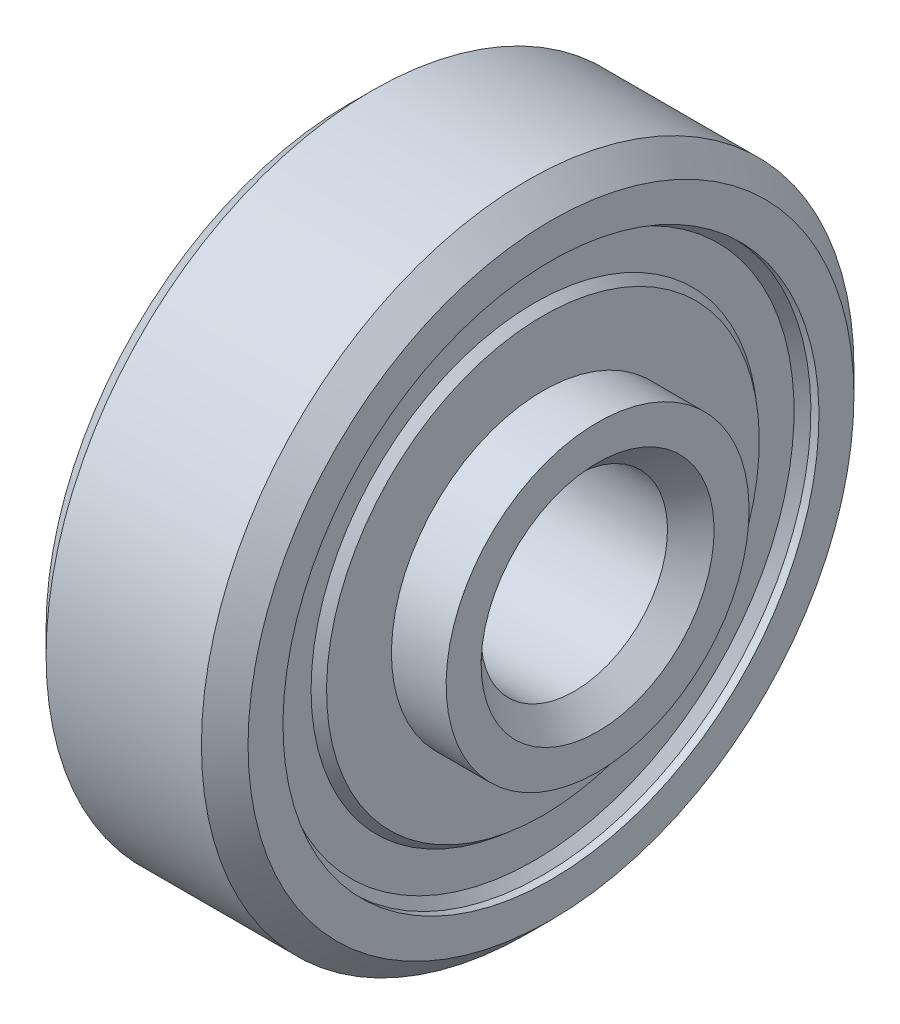
ISO-10303-21;
HEADER;
FILE_DESCRIPTION(('STEP AP214'),'2;1');
FILE_NAME('part.step','',(''),(''),'','','');
FILE_SCHEMA(('AUTOMOTIVE_DESIGN { 1 0 10303 214 1 1 1 1 }'));
ENDSEC;
DATA;
#1=APPLICATION_CONTEXT('core data for automotive mechanical design processes');
#2=APPLICATION_PROTOCOL_DEFINITION('international standard','automotive_design',2000,#1);
#3=PRODUCT_CONTEXT('',#1,'mechanical');
#4=PRODUCT('Part','Part','',(#3));
#5=PRODUCT_RELATED_PRODUCT_CATEGORY('part','',(#4));
#6=PRODUCT_DEFINITION_FORMATION('','',#4);
#7=PRODUCT_DEFINITION_CONTEXT('part definition',#1,'design');
#8=PRODUCT_DEFINITION('design','',#6,#7);
#9=PRODUCT_DEFINITION_SHAPE('','',#8);
#10=(LENGTH_UNIT() NAMED_UNIT(*) SI_UNIT(.MILLI.,.METRE.));
#11=(NAMED_UNIT(*) PLANE_ANGLE_UNIT() SI_UNIT($,.RADIAN.));
#12=(NAMED_UNIT(*) SI_UNIT($,.STERADIAN.) SOLID_ANGLE_UNIT());
#13=UNCERTAINTY_MEASURE_WITH_UNIT(LENGTH_MEASURE(1.E-05),#10,'distance_accuracy_value','');
#14=(GEOMETRIC_REPRESENTATION_CONTEXT(3) GLOBAL_UNCERTAINTY_ASSIGNED_CONTEXT((#13)) GLOBAL_UNIT_ASSIGNED_CONTEXT((#10,
#11,#12)) REPRESENTATION_CONTEXT('',''));
#15=CARTESIAN_POINT('',(0.,0.,0.));
#16=DIRECTION('',(0.,0.,1.));
#17=DIRECTION('',(1.,0.,0.));
#18=AXIS2_PLACEMENT_3D('',#15,#16,#17);
#19=CARTESIAN_POINT('',(11.6666666666667,0.,0.));
#20=DIRECTION('',(-1.,0.,0.));
#21=DIRECTION('',(0.,-1.,0.));
#22=AXIS2_PLACEMENT_3D('',#19,#20,#21);
#23=TOROIDAL_SURFACE('',#22,13.3249973942044,1.875);
#24=CARTESIAN_POINT('',(12.0967939863605,0.,0.));
#25=DIRECTION('',(-1.,0.,0.));
#26=DIRECTION('',(0.,-1.,0.));
#27=AXIS2_PLACEMENT_3D('',#24,#25,#26);
#28=CIRCLE('',#27,11.4999999999999);
#29=CARTESIAN_POINT('',(12.0967939863606,-11.4999999999998,0.));
#30=VERTEX_POINT('',#29);
#31=EDGE_CURVE('E89',#30,#30,#28,.T.);
#32=ORIENTED_EDGE('',*,*,#31,.T.);
#33=EDGE_LOOP('',(#32));
#34=FACE_BOUND('',#33,.T.);
#35=CARTESIAN_POINT('',(11.236539346973,0.,0.));
#36=DIRECTION('',(-1.,0.,0.));
#37=DIRECTION('',(0.,-1.,0.));
#38=AXIS2_PLACEMENT_3D('',#35,#36,#37);
#39=CIRCLE('',#38,11.4999999999999);
#40=CARTESIAN_POINT('',(11.2365393469731,-11.4999999999999,0.));
#41=VERTEX_POINT('',#40);
#42=EDGE_CURVE('E11',#41,#41,#39,.T.);
#43=ORIENTED_EDGE('',*,*,#42,.F.);
#44=EDGE_LOOP('',(#43));
#45=FACE_BOUND('',#44,.T.);
#46=ADVANCED_FACE('F43',(#34,#45),#23,.F.);
#47=CARTESIAN_POINT('',(0.,0.,0.));
#48=DIRECTION('',(-1.,0.,0.));
#49=DIRECTION('',(0.,-1.,0.));
#50=AXIS2_PLACEMENT_3D('',#47,#48,#49);
#51=CYLINDRICAL_SURFACE('',#50,11.4999999999999);
#52=ORIENTED_EDGE('',*,*,#42,.T.);
#53=EDGE_LOOP('',(#52));
#54=FACE_BOUND('',#53,.T.);
#55=CARTESIAN_POINT('',(7.76346065302716,0.,0.));
#56=DIRECTION('',(-1.,0.,0.));
#57=DIRECTION('',(0.,-1.,0.));
#58=AXIS2_PLACEMENT_3D('',#55,#56,#57);
#59=CIRCLE('',#58,11.5);
#60=CARTESIAN_POINT('',(7.76346065302723,-11.4999999999999,0.));
#61=VERTEX_POINT('',#60);
#62=EDGE_CURVE('E49',#61,#61,#59,.T.);
#63=ORIENTED_EDGE('',*,*,#62,.F.);
#64=EDGE_LOOP('',(#63));
#65=FACE_BOUND('',#64,.T.);
#66=ADVANCED_FACE('F107',(#54,#65),#51,.T.);
#67=CARTESIAN_POINT('',(7.33333333333341,0.,0.));
#68=DIRECTION('',(-1.,0.,0.));
#69=DIRECTION('',(0.,-1.,0.));
#70=AXIS2_PLACEMENT_3D('',#67,#68,#69);
#71=TOROIDAL_SURFACE('',#70,13.3249973942044,1.875);
#72=ORIENTED_EDGE('',*,*,#62,.T.);
#73=EDGE_LOOP('',(#72));
#74=FACE_BOUND('',#73,.T.);
#75=CARTESIAN_POINT('',(6.90320601363964,0.,0.));
#76=DIRECTION('',(-1.,0.,0.));
#77=DIRECTION('',(0.,-1.,0.));
#78=AXIS2_PLACEMENT_3D('',#75,#76,#77);
#79=CIRCLE('',#78,11.5);
#80=CARTESIAN_POINT('',(6.90320601363971,-11.4999999999999,0.));
#81=VERTEX_POINT('',#80);
#82=EDGE_CURVE('E53',#81,#81,#79,.T.);
#83=ORIENTED_EDGE('',*,*,#82,.F.);
#84=EDGE_LOOP('',(#83));
#85=FACE_BOUND('',#84,.T.);
#86=ADVANCED_FACE('F111',(#74,#85),#71,.F.);
#87=CARTESIAN_POINT('',(0.,0.,0.));
#88=DIRECTION('',(-1.,0.,0.));
#89=DIRECTION('',(0.,-1.,0.));
#90=AXIS2_PLACEMENT_3D('',#87,#88,#89);
#91=CYLINDRICAL_SURFACE('',#90,11.5);
#92=ORIENTED_EDGE('',*,*,#82,.T.);
#93=EDGE_LOOP('',(#92));
#94=FACE_BOUND('',#93,.T.);
#95=CARTESIAN_POINT('',(5.16666666666674,0.,0.));
#96=DIRECTION('',(-1.,0.,0.));
#97=DIRECTION('',(0.,-1.,0.));
#98=AXIS2_PLACEMENT_3D('',#95,#96,#97);
#99=CIRCLE('',#98,11.5);
#100=CARTESIAN_POINT('',(5.16666666666681,-11.4999999999999,0.));
#101=VERTEX_POINT('',#100);
#102=EDGE_CURVE('E57',#101,#101,#99,.T.);
#103=ORIENTED_EDGE('',*,*,#102,.F.);
#104=EDGE_LOOP('',(#103));
#105=FACE_BOUND('',#104,.T.);
#106=ADVANCED_FACE('F115',(#94,#105),#91,.T.);
#107=CARTESIAN_POINT('',(4.62500000000006,0.,0.));
#108=DIRECTION('',(1.,0.,0.));
#109=DIRECTION('',(0.,1.,0.));
#110=AXIS2_PLACEMENT_3D('',#107,#108,#109);
#111=CONICAL_SURFACE('',#110,9.74999999999997,1.27062515596478);
#112=ORIENTED_EDGE('',*,*,#102,.T.);
#113=EDGE_LOOP('',(#112));
#114=FACE_BOUND('',#113,.T.);
#115=CARTESIAN_POINT('',(4.62500000000006,0.,0.));
#116=DIRECTION('',(-1.,0.,0.));
#117=DIRECTION('',(0.,-1.,0.));
#118=AXIS2_PLACEMENT_3D('',#115,#116,#117);
#119=CIRCLE('',#118,9.74999999999997);
#120=CARTESIAN_POINT('',(4.62500000000012,-9.74999999999995,0.));
#121=VERTEX_POINT('',#120);
#122=EDGE_CURVE('E62',#121,#121,#119,.T.);
#123=ORIENTED_EDGE('',*,*,#122,.F.);
#124=EDGE_LOOP('',(#123));
#125=FACE_BOUND('',#124,.T.);
#126=ADVANCED_FACE('F121',(#114,#125),#111,.T.);
#127=CARTESIAN_POINT('',(0.,0.,0.));
#128=DIRECTION('',(-1.,0.,0.));
#129=DIRECTION('',(0.,-1.,0.));
#130=AXIS2_PLACEMENT_3D('',#127,#128,#129);
#131=CYLINDRICAL_SURFACE('',#130,9.74999999999999);
#132=ORIENTED_EDGE('',*,*,#122,.T.);
#133=EDGE_LOOP('',(#132));
#134=FACE_BOUND('',#133,.T.);
#135=CARTESIAN_POINT('',(0.,0.,0.));
#136=DIRECTION('',(-1.,0.,0.));
#137=DIRECTION('',(0.,-1.,0.));
#138=AXIS2_PLACEMENT_3D('',#135,#136,#137);
#139=CIRCLE('',#138,9.75);
#140=CARTESIAN_POINT('',(1.15715623682421E-13,-9.75,0.));
#141=VERTEX_POINT('',#140);
#142=EDGE_CURVE('E65',#141,#141,#139,.T.);
#143=ORIENTED_EDGE('',*,*,#142,.F.);
#144=EDGE_LOOP('',(#143));
#145=FACE_BOUND('',#144,.T.);
#146=ADVANCED_FACE('F125',(#134,#145),#131,.T.);
#147=CARTESIAN_POINT('',(1.52655665885959E-13,-5.47038840179403,0.));
#148=DIRECTION('',(-1.,0.,0.));
#149=DIRECTION('',(0.,-1.,0.));
#150=AXIS2_PLACEMENT_3D('',#147,#148,#149);
#151=PLANE('',#150);
#152=ORIENTED_EDGE('',*,*,#142,.T.);
#153=EDGE_LOOP('',(#152));
#154=FACE_BOUND('',#153,.T.);
#155=CARTESIAN_POINT('',(0.,0.,0.));
#156=DIRECTION('',(-1.,0.,0.));
#157=DIRECTION('',(0.,-1.,0.));
#158=AXIS2_PLACEMENT_3D('',#155,#156,#157);
#159=CIRCLE('',#158,7.50000000010686);
#160=CARTESIAN_POINT('',(1.01822283886659E-13,-7.50000000010686,0.));
#161=VERTEX_POINT('',#160);
#162=EDGE_CURVE('E68',#161,#161,#159,.T.);
#163=ORIENTED_EDGE('',*,*,#162,.F.);
#164=EDGE_LOOP('',(#163));
#165=FACE_BOUND('',#164,.T.);
#166=ADVANCED_FACE('F129',(#154,#165),#151,.T.);
#167=CARTESIAN_POINT('',(0.,0.,0.));
#168=DIRECTION('',(-1.,0.,0.));
#169=DIRECTION('',(0.,-1.,0.));
#170=AXIS2_PLACEMENT_3D('',#167,#168,#169);
#171=CONICAL_SURFACE('',#170,7.50000000010686,0.785398163397455);
#172=CARTESIAN_POINT('',(1.5000000001103,0.,0.));
#173=DIRECTION('',(-1.,0.,0.));
#174=DIRECTION('',(0.,-1.,0.));
#175=AXIS2_PLACEMENT_3D('',#172,#173,#174);
#176=CIRCLE('',#175,5.99999999999658);
#177=CARTESIAN_POINT('',(1.50000000011034,-5.99999999999658,0.));
#178=VERTEX_POINT('',#177);
#179=EDGE_CURVE('E71',#178,#178,#176,.T.);
#180=ORIENTED_EDGE('',*,*,#179,.F.);
#181=EDGE_LOOP('',(#180));
#182=FACE_BOUND('',#181,.T.);
#183=ORIENTED_EDGE('',*,*,#162,.T.);
#184=EDGE_LOOP('',(#183));
#185=FACE_BOUND('',#184,.T.);
#186=ADVANCED_FACE('F133',(#182,#185),#171,.F.);
#187=CARTESIAN_POINT('',(0.,0.,0.));
#188=DIRECTION('',(-1.,0.,0.));
#189=DIRECTION('',(0.,-1.,0.));
#190=AXIS2_PLACEMENT_3D('',#187,#188,#189);
#191=CYLINDRICAL_SURFACE('',#190,5.99999999999653);
#192=CARTESIAN_POINT('',(17.5000000001104,1.06685493772574E-13,0.));
#193=DIRECTION('',(-1.,0.,0.));
#194=DIRECTION('',(0.,-1.,0.));
#195=AXIS2_PLACEMENT_3D('',#192,#193,#194);
#196=CIRCLE('',#195,5.99999999999648);
#197=CARTESIAN_POINT('',(17.5000000001104,-5.99999999999638,0.));
#198=VERTEX_POINT('',#197);
#199=EDGE_CURVE('E74',#198,#198,#196,.T.);
#200=ORIENTED_EDGE('',*,*,#199,.F.);
#201=EDGE_LOOP('',(#200));
#202=FACE_BOUND('',#201,.T.);
#203=ORIENTED_EDGE('',*,*,#179,.T.);
#204=EDGE_LOOP('',(#203));
#205=FACE_BOUND('',#204,.T.);
#206=ADVANCED_FACE('F137',(#202,#205),#191,.F.);
#207=CARTESIAN_POINT('',(17.5000000001104,1.06685493772574E-13,0.));
#208=DIRECTION('',(1.,0.,0.));
#209=DIRECTION('',(0.,1.,0.));
#210=AXIS2_PLACEMENT_3D('',#207,#208,#209);
#211=CONICAL_SURFACE('',#210,5.99999999999648,0.785398163397442);
#212=CARTESIAN_POINT('',(19.0000000001104,1.17961196366423E-13,0.));
#213=DIRECTION('',(-1.,0.,0.));
#214=DIRECTION('',(0.,-1.,0.));
#215=AXIS2_PLACEMENT_3D('',#212,#213,#214);
#216=CIRCLE('',#215,7.49999999999647);
#217=CARTESIAN_POINT('',(19.0000000001104,-7.49999999999636,0.));
#218=VERTEX_POINT('',#217);
#219=EDGE_CURVE('E77',#218,#218,#216,.T.);
#220=ORIENTED_EDGE('',*,*,#219,.F.);
#221=EDGE_LOOP('',(#220));
#222=FACE_BOUND('',#221,.T.);
#223=ORIENTED_EDGE('',*,*,#199,.T.);
#224=EDGE_LOOP('',(#223));
#225=FACE_BOUND('',#224,.T.);
#226=ADVANCED_FACE('F141',(#222,#225),#211,.F.);
#227=CARTESIAN_POINT('',(19.0000000001104,-5.47038840179402,0.));
#228=DIRECTION('',(-1.,0.,0.));
#229=DIRECTION('',(0.,-1.,0.));
#230=AXIS2_PLACEMENT_3D('',#227,#228,#229);
#231=PLANE('',#230);
#232=CARTESIAN_POINT('',(19.0000000001104,1.17961196366423E-13,0.));
#233=DIRECTION('',(-1.,0.,0.));
#234=DIRECTION('',(0.,-1.,0.));
#235=AXIS2_PLACEMENT_3D('',#232,#233,#234);
#236=CIRCLE('',#235,9.74999999999988);
#237=CARTESIAN_POINT('',(19.0000000001104,-9.74999999999976,0.));
#238=VERTEX_POINT('',#237);
#239=EDGE_CURVE('E80',#238,#238,#236,.T.);
#240=ORIENTED_EDGE('',*,*,#239,.F.);
#241=EDGE_LOOP('',(#240));
#242=FACE_BOUND('',#241,.T.);
#243=ORIENTED_EDGE('',*,*,#219,.T.);
#244=EDGE_LOOP('',(#243));
#245=FACE_BOUND('',#244,.T.);
#246=ADVANCED_FACE('F145',(#242,#245),#231,.F.);
#247=CARTESIAN_POINT('',(0.,0.,0.));
#248=DIRECTION('',(-1.,0.,0.));
#249=DIRECTION('',(0.,-1.,0.));
#250=AXIS2_PLACEMENT_3D('',#247,#248,#249);
#251=CYLINDRICAL_SURFACE('',#250,9.7499999999999);
#252=ORIENTED_EDGE('',*,*,#239,.T.);
#253=EDGE_LOOP('',(#252));
#254=FACE_BOUND('',#253,.T.);
#255=CARTESIAN_POINT('',(14.3750000000001,0.,0.));
#256=DIRECTION('',(-1.,0.,0.));
#257=DIRECTION('',(0.,-1.,0.));
#258=AXIS2_PLACEMENT_3D('',#255,#256,#257);
#259=CIRCLE('',#258,9.74999999999991);
#260=CARTESIAN_POINT('',(14.3750000000001,-9.74999999999982,0.));
#261=VERTEX_POINT('',#260);
#262=EDGE_CURVE('E83',#261,#261,#259,.T.);
#263=ORIENTED_EDGE('',*,*,#262,.F.);
#264=EDGE_LOOP('',(#263));
#265=FACE_BOUND('',#264,.T.);
#266=ADVANCED_FACE('F103',(#254,#265),#251,.T.);
#267=CARTESIAN_POINT('',(13.8333333333334,0.,0.));
#268=DIRECTION('',(-1.,0.,0.));
#269=DIRECTION('',(0.,-1.,0.));
#270=AXIS2_PLACEMENT_3D('',#267,#268,#269);
#271=CONICAL_SURFACE('',#270,11.4999999999999,1.27062515596479);
#272=ORIENTED_EDGE('',*,*,#262,.T.);
#273=EDGE_LOOP('',(#272));
#274=FACE_BOUND('',#273,.T.);
#275=CARTESIAN_POINT('',(13.8333333333334,0.,0.));
#276=DIRECTION('',(-1.,0.,0.));
#277=DIRECTION('',(0.,-1.,0.));
#278=AXIS2_PLACEMENT_3D('',#275,#276,#277);
#279=CIRCLE('',#278,11.4999999999999);
#280=CARTESIAN_POINT('',(13.8333333333335,-11.4999999999998,0.));
#281=VERTEX_POINT('',#280);
#282=EDGE_CURVE('E86',#281,#281,#279,.T.);
#283=ORIENTED_EDGE('',*,*,#282,.F.);
#284=EDGE_LOOP('',(#283));
#285=FACE_BOUND('',#284,.T.);
#286=ADVANCED_FACE('F97',(#274,#285),#271,.T.);
#287=CARTESIAN_POINT('',(0.,0.,0.));
#288=DIRECTION('',(-1.,0.,0.));
#289=DIRECTION('',(0.,-1.,0.));
#290=AXIS2_PLACEMENT_3D('',#287,#288,#289);
#291=CYLINDRICAL_SURFACE('',#290,11.4999999999999);
#292=ORIENTED_EDGE('',*,*,#282,.T.);
#293=EDGE_LOOP('',(#292));
#294=FACE_BOUND('',#293,.T.);
#295=ORIENTED_EDGE('',*,*,#31,.F.);
#296=EDGE_LOOP('',(#295));
#297=FACE_BOUND('',#296,.T.);
#298=ADVANCED_FACE('F95',(#294,#297),#291,.T.);
#299=CLOSED_SHELL('',(#46,#66,#86,#106,#126,#146,#166,#186,#206,#226,#246,#266,#286,#298));
#300=MANIFOLD_SOLID_BREP('B2',#299);
#301=CARTESIAN_POINT('',(9.50000000000001,0.,0.));
#302=DIRECTION('',(-1.,0.,0.));
#303=DIRECTION('',(0.,1.,0.));
#304=AXIS2_PLACEMENT_3D('',#301,#302,#303);
#305=SPHERICAL_SURFACE('',#304,15.375);
#306=CARTESIAN_POINT('',(5.16666666666676,0.,0.));
#307=DIRECTION('',(-1.,0.,0.));
#308=DIRECTION('',(0.,-1.,0.));
#309=AXIS2_PLACEMENT_3D('',#306,#307,#308);
#310=CIRCLE('',#309,14.7517065867723);
#311=CARTESIAN_POINT('',(5.16666666666667,14.7517065867723,0.));
#312=VERTEX_POINT('',#311);
#313=EDGE_CURVE('E314',#312,#312,#310,.T.);
#314=CARTESIAN_POINT('',(13.8333333333334,0.,0.));
#315=DIRECTION('',(-1.,0.,0.));
#316=DIRECTION('',(0.,-1.,0.));
#317=AXIS2_PLACEMENT_3D('',#314,#315,#316);
#318=CIRCLE('',#317,14.7517065867723);
#319=CARTESIAN_POINT('',(13.8333333333333,14.7517065867723,0.));
#320=VERTEX_POINT('',#319);
#321=EDGE_CURVE('E42',#320,#320,#318,.T.);
#322=CARTESIAN_POINT('',(5.16666666666667,14.7517065867723,0.));
#323=CARTESIAN_POINT('',(5.2544744083613,14.7775003246166,0.));
#324=CARTESIAN_POINT('',(5.34251249946757,14.8025098875159,0.));
#325=CARTESIAN_POINT('',(5.51902119911412,14.8509530849714,0.));
#326=CARTESIAN_POINT('',(5.60749180765442,14.8743867195275,0.));
#327=CARTESIAN_POINT('',(5.78483736077979,14.9196704818431,0.));
#328=CARTESIAN_POINT('',(5.87371230536488,14.9415206096025,0.));
#329=CARTESIAN_POINT('',(6.05183818330579,14.9836304194508,0.));
#330=CARTESIAN_POINT('',(6.14108911666162,15.0038901015398,0.));
#331=CARTESIAN_POINT('',(6.31993851488075,15.0428125522382,0.));
#332=CARTESIAN_POINT('',(6.40953697974405,15.0614753208477,0.));
#333=CARTESIAN_POINT('',(6.58905287024463,15.0971979956518,0.));
#334=CARTESIAN_POINT('',(6.6789702958819,15.1142579018465,0.));
#335=CARTESIAN_POINT('',(6.85909543620113,15.1467694113984,0.));
#336=CARTESIAN_POINT('',(6.94930315088309,15.1622210147556,0.));
#337=CARTESIAN_POINT('',(7.12998010480774,15.191510991742,0.));
#338=CARTESIAN_POINT('',(7.22044934405043,15.2053493653711,0.));
#339=CARTESIAN_POINT('',(7.40162049927156,15.2314084702337,0.));
#340=CARTESIAN_POINT('',(7.49232241525,15.2436292014671,0.));
#341=CARTESIAN_POINT('',(7.67393000191058,15.2664491247364,0.));
#342=CARTESIAN_POINT('',(7.76483567259271,15.2770483167723,0.));
#343=CARTESIAN_POINT('',(7.94682178166121,15.29662178189,0.));
#344=CARTESIAN_POINT('',(8.03790222004757,15.3055960549718,0.));
#345=CARTESIAN_POINT('',(8.22020882179611,15.3219168205645,0.));
#346=CARTESIAN_POINT('',(8.31143498515827,15.3292633130755,0.));
#347=CARTESIAN_POINT('',(8.49400394766305,15.3423261749576,0.));
#348=CARTESIAN_POINT('',(8.58534674680566,15.3480425443289,0.));
#349=CARTESIAN_POINT('',(8.76811985448437,15.3578433371586,0.));
#350=CARTESIAN_POINT('',(8.85955016302047,15.3619277606172,0.));
#351=CARTESIAN_POINT('',(9.04246913519519,15.3684633592256,0.));
#352=CARTESIAN_POINT('',(9.1339577988338,15.3709145343754,0.));
#353=CARTESIAN_POINT('',(9.31696430831495,15.3741828547626,0.));
#354=CARTESIAN_POINT('',(9.40848215415747,15.375,0.));
#355=CARTESIAN_POINT('',(9.59151784584252,15.375,0.));
#356=CARTESIAN_POINT('',(9.68303569168505,15.3741828547626,0.));
#357=CARTESIAN_POINT('',(9.8660422011662,15.3709145343754,0.));
#358=CARTESIAN_POINT('',(9.95753086480481,15.3684633592256,0.));
#359=CARTESIAN_POINT('',(10.1404498369795,15.3619277606172,0.));
#360=CARTESIAN_POINT('',(10.2318801455156,15.3578433371586,0.));
#361=CARTESIAN_POINT('',(10.4146532531943,15.3480425443289,0.));
#362=CARTESIAN_POINT('',(10.505996052337,15.3423261749576,0.));
#363=CARTESIAN_POINT('',(10.6885650148417,15.3292633130755,0.));
#364=CARTESIAN_POINT('',(10.7797911782039,15.3219168205645,0.));
#365=CARTESIAN_POINT('',(10.9620977799524,15.3055960549718,0.));
#366=CARTESIAN_POINT('',(11.0531782183388,15.29662178189,0.));
#367=CARTESIAN_POINT('',(11.2351643274073,15.2770483167723,0.));
#368=CARTESIAN_POINT('',(11.3260699980894,15.2664491247364,0.));
#369=CARTESIAN_POINT('',(11.50767758475,15.2436292014671,0.));
#370=CARTESIAN_POINT('',(11.5983795007284,15.2314084702337,0.));
#371=CARTESIAN_POINT('',(11.7795506559496,15.2053493653711,0.));
#372=CARTESIAN_POINT('',(11.8700198951923,15.191510991742,0.));
#373=CARTESIAN_POINT('',(12.0506968491169,15.1622210147556,0.));
#374=CARTESIAN_POINT('',(12.1409045637989,15.1467694113984,0.));
#375=CARTESIAN_POINT('',(12.3210297041181,15.1142579018465,0.));
#376=CARTESIAN_POINT('',(12.4109471297554,15.0971979956518,0.));
#377=CARTESIAN_POINT('',(12.5904630202559,15.0614753208477,0.));
#378=CARTESIAN_POINT('',(12.6800614851193,15.0428125522382,0.));
#379=CARTESIAN_POINT('',(12.8589108833384,15.0038901015398,0.));
#380=CARTESIAN_POINT('',(12.9481618166942,14.9836304194508,0.));
#381=CARTESIAN_POINT('',(13.1262876946351,14.9415206096025,0.));
#382=CARTESIAN_POINT('',(13.2151626392202,14.9196704818431,0.));
#383=CARTESIAN_POINT('',(13.3925081923456,14.8743867195275,0.));
#384=CARTESIAN_POINT('',(13.4809788008859,14.8509530849714,0.));
#385=CARTESIAN_POINT('',(13.6574875005324,14.8025098875159,0.));
#386=CARTESIAN_POINT('',(13.7455255916387,14.7775003246166,0.));
#387=CARTESIAN_POINT('',(13.8333333333333,14.7517065867723,0.));
#388=B_SPLINE_CURVE_WITH_KNOTS('',3,(#322,#323,#324,#325,#326,#327,#328,#329,#330,#331,#332,
#333,#334,#335,#336,#337,#338,#339,#340,#341,#342,#343,#344,#345,#346,#347,#348,#349,#350,#351,
#352,#353,#354,#355,#356,#357,#358,#359,#360,#361,#362,#363,#364,#365,#366,#367,#368,#369,#370,
#371,#372,#373,#374,#375,#376,#377,#378,#379,#380,#381,#382,#383,#384,#385,#386,#387),
.UNSPECIFIED.,.F.,.F.,(4,2,2,2,2,2,2,2,2,2,2,2,2,2,2,2,2,2,2,2,2,2,2,2,2,2,2,2,2,2,2,2,4),(0.,
0.274549889824796,0.54909977964959,0.823649669474385,1.09819955929918,1.37274944912398,
1.64729933894877,1.92184922877357,2.19639911859836,2.47094900842316,2.74549889824795,
3.02004878807275,3.29459867789754,3.56914856772234,3.84369845754713,4.11824834737193,
4.39279823719672,4.66734812702152,4.94189801684631,5.2164479066711,5.4909977964959,
5.76554768632069,6.04009757614549,6.31464746597029,6.58919735579508,6.86374724561987,
7.13829713544467,7.41284702526947,7.68739691509426,7.96194680491905,8.23649669474385,
8.51104658456864,8.78559647439344),.UNSPECIFIED.);
#389=EDGE_CURVE('BSEAM274',#312,#320,#388,.T.);
#390=ORIENTED_EDGE('',*,*,#313,.T.);
#391=ORIENTED_EDGE('',*,*,#321,.F.);
#392=ORIENTED_EDGE('',*,*,#389,.T.);
#393=ORIENTED_EDGE('',*,*,#389,.F.);
#394=EDGE_LOOP('',(#390,#392,#391,#393));
#395=FACE_BOUND('',#394,.T.);
#396=ADVANCED_FACE('F274',(#395),#305,.F.);
#397=CARTESIAN_POINT('',(13.8333333333335,-5.47038840179402,0.));
#398=DIRECTION('',(1.,0.,0.));
#399=DIRECTION('',(0.,1.,0.));
#400=AXIS2_PLACEMENT_3D('',#397,#398,#399);
#401=PLANE('',#400);
#402=ORIENTED_EDGE('',*,*,#321,.T.);
#403=EDGE_LOOP('',(#402));
#404=FACE_BOUND('',#403,.T.);
#405=CARTESIAN_POINT('',(13.8333333333334,0.,0.));
#406=DIRECTION('',(-1.,0.,0.));
#407=DIRECTION('',(0.,-1.,0.));
#408=AXIS2_PLACEMENT_3D('',#405,#406,#407);
#409=CIRCLE('',#408,18.8966666666666);
#410=CARTESIAN_POINT('',(13.8333333333336,-18.8966666666665,0.));
#411=VERTEX_POINT('',#410);
#412=EDGE_CURVE('E280',#411,#411,#409,.T.);
#413=ORIENTED_EDGE('',*,*,#412,.F.);
#414=EDGE_LOOP('',(#413));
#415=FACE_BOUND('',#414,.T.);
#416=ADVANCED_FACE('F350',(#404,#415),#401,.T.);
#417=CARTESIAN_POINT('',(13.8333333333334,0.,0.));
#418=DIRECTION('',(-1.,0.,0.));
#419=DIRECTION('',(0.,-1.,0.));
#420=AXIS2_PLACEMENT_3D('',#417,#418,#419);
#421=CONICAL_SURFACE('',#420,18.8966666666666,0.78539816339745);
#422=CARTESIAN_POINT('',(15.4800000000001,0.,0.));
#423=DIRECTION('',(-1.,0.,0.));
#424=DIRECTION('',(0.,-1.,0.));
#425=AXIS2_PLACEMENT_3D('',#422,#423,#424);
#426=CIRCLE('',#425,17.2499999999999);
#427=CARTESIAN_POINT('',(15.4800000000002,-17.2499999999998,0.));
#428=VERTEX_POINT('',#427);
#429=EDGE_CURVE('E284',#428,#428,#426,.T.);
#430=ORIENTED_EDGE('',*,*,#429,.F.);
#431=EDGE_LOOP('',(#430));
#432=FACE_BOUND('',#431,.T.);
#433=ORIENTED_EDGE('',*,*,#412,.T.);
#434=EDGE_LOOP('',(#433));
#435=FACE_BOUND('',#434,.T.);
#436=ADVANCED_FACE('F354',(#432,#435),#421,.F.);
#437=CARTESIAN_POINT('',(0.,0.,0.));
#438=DIRECTION('',(-1.,0.,0.));
#439=DIRECTION('',(0.,-1.,0.));
#440=AXIS2_PLACEMENT_3D('',#437,#438,#439);
#441=CYLINDRICAL_SURFACE('',#440,17.2499999999999);
#442=CARTESIAN_POINT('',(16.0000000000001,0.,0.));
#443=DIRECTION('',(-1.,0.,0.));
#444=DIRECTION('',(0.,-1.,0.));
#445=AXIS2_PLACEMENT_3D('',#442,#443,#444);
#446=CIRCLE('',#445,17.2499999999999);
#447=CARTESIAN_POINT('',(16.0000000000002,-17.2499999999998,0.));
#448=VERTEX_POINT('',#447);
#449=EDGE_CURVE('E288',#448,#448,#446,.T.);
#450=ORIENTED_EDGE('',*,*,#449,.F.);
#451=EDGE_LOOP('',(#450));
#452=FACE_BOUND('',#451,.T.);
#453=ORIENTED_EDGE('',*,*,#429,.T.);
#454=EDGE_LOOP('',(#453));
#455=FACE_BOUND('',#454,.T.);
#456=ADVANCED_FACE('F358',(#452,#455),#441,.F.);
#457=CARTESIAN_POINT('',(16.0000000000002,-5.47038840179403,0.));
#458=DIRECTION('',(-1.,0.,0.));
#459=DIRECTION('',(0.,-1.,0.));
#460=AXIS2_PLACEMENT_3D('',#457,#458,#459);
#461=PLANE('',#460);
#462=CARTESIAN_POINT('',(16.0000000000001,0.,0.));
#463=DIRECTION('',(-1.,0.,0.));
#464=DIRECTION('',(0.,-1.,0.));
#465=AXIS2_PLACEMENT_3D('',#462,#463,#464);
#466=CIRCLE('',#465,19.4999999999999);
#467=CARTESIAN_POINT('',(16.0000000000002,-19.4999999999998,0.));
#468=VERTEX_POINT('',#467);
#469=EDGE_CURVE('E293',#468,#468,#466,.T.);
#470=ORIENTED_EDGE('',*,*,#469,.F.);
#471=EDGE_LOOP('',(#470));
#472=FACE_BOUND('',#471,.T.);
#473=ORIENTED_EDGE('',*,*,#449,.T.);
#474=EDGE_LOOP('',(#473));
#475=FACE_BOUND('',#474,.T.);
#476=ADVANCED_FACE('F365',(#472,#475),#461,.F.);
#477=CARTESIAN_POINT('',(14.5000000000001,0.,0.));
#478=DIRECTION('',(-1.,0.,0.));
#479=DIRECTION('',(0.,-1.,0.));
#480=AXIS2_PLACEMENT_3D('',#477,#478,#479);
#481=CONICAL_SURFACE('',#480,20.9999999999999,0.785398163397459);
#482=ORIENTED_EDGE('',*,*,#469,.T.);
#483=EDGE_LOOP('',(#482));
#484=FACE_BOUND('',#483,.T.);
#485=CARTESIAN_POINT('',(14.5000000000001,0.,0.));
#486=DIRECTION('',(-1.,0.,0.));
#487=DIRECTION('',(0.,-1.,0.));
#488=AXIS2_PLACEMENT_3D('',#485,#486,#487);
#489=CIRCLE('',#488,20.9999999999999);
#490=CARTESIAN_POINT('',(14.5000000000003,-20.9999999999998,0.));
#491=VERTEX_POINT('',#490);
#492=EDGE_CURVE('E296',#491,#491,#489,.T.);
#493=ORIENTED_EDGE('',*,*,#492,.F.);
#494=EDGE_LOOP('',(#493));
#495=FACE_BOUND('',#494,.T.);
#496=ADVANCED_FACE('F369',(#484,#495),#481,.T.);
#497=CARTESIAN_POINT('',(0.,0.,0.));
#498=DIRECTION('',(-1.,0.,0.));
#499=DIRECTION('',(0.,-1.,0.));
#500=AXIS2_PLACEMENT_3D('',#497,#498,#499);
#501=CYLINDRICAL_SURFACE('',#500,20.9999999999999);
#502=ORIENTED_EDGE('',*,*,#492,.T.);
#503=EDGE_LOOP('',(#502));
#504=FACE_BOUND('',#503,.T.);
#505=CARTESIAN_POINT('',(4.50000000000012,0.,0.));
#506=DIRECTION('',(-1.,0.,0.));
#507=DIRECTION('',(0.,-1.,0.));
#508=AXIS2_PLACEMENT_3D('',#505,#506,#507);
#509=CIRCLE('',#508,21.);
#510=CARTESIAN_POINT('',(4.50000000000025,-21.,0.));
#511=VERTEX_POINT('',#510);
#512=EDGE_CURVE('E299',#511,#511,#509,.T.);
#513=ORIENTED_EDGE('',*,*,#512,.F.);
#514=EDGE_LOOP('',(#513));
#515=FACE_BOUND('',#514,.T.);
#516=ADVANCED_FACE('F346',(#504,#515),#501,.T.);
#517=CARTESIAN_POINT('',(3.00000000000011,0.,0.));
#518=DIRECTION('',(1.,0.,0.));
#519=DIRECTION('',(0.,1.,0.));
#520=AXIS2_PLACEMENT_3D('',#517,#518,#519);
#521=CONICAL_SURFACE('',#520,19.5,0.785398163397442);
#522=ORIENTED_EDGE('',*,*,#512,.T.);
#523=EDGE_LOOP('',(#522));
#524=FACE_BOUND('',#523,.T.);
#525=CARTESIAN_POINT('',(3.00000000000011,0.,0.));
#526=DIRECTION('',(-1.,0.,0.));
#527=DIRECTION('',(0.,-1.,0.));
#528=AXIS2_PLACEMENT_3D('',#525,#526,#527);
#529=CIRCLE('',#528,19.5);
#530=CARTESIAN_POINT('',(3.00000000000023,-19.5,0.));
#531=VERTEX_POINT('',#530);
#532=EDGE_CURVE('E302',#531,#531,#529,.T.);
#533=ORIENTED_EDGE('',*,*,#532,.F.);
#534=EDGE_LOOP('',(#533));
#535=FACE_BOUND('',#534,.T.);
#536=ADVANCED_FACE('F340',(#524,#535),#521,.T.);
#537=CARTESIAN_POINT('',(3.00000000000021,-5.47038840179402,0.));
#538=DIRECTION('',(-1.,0.,0.));
#539=DIRECTION('',(0.,-1.,0.));
#540=AXIS2_PLACEMENT_3D('',#537,#538,#539);
#541=PLANE('',#540);
#542=ORIENTED_EDGE('',*,*,#532,.T.);
#543=EDGE_LOOP('',(#542));
#544=FACE_BOUND('',#543,.T.);
#545=CARTESIAN_POINT('',(3.00000000000011,0.,0.));
#546=DIRECTION('',(-1.,0.,0.));
#547=DIRECTION('',(0.,-1.,0.));
#548=AXIS2_PLACEMENT_3D('',#545,#546,#547);
#549=CIRCLE('',#548,17.25);
#550=CARTESIAN_POINT('',(3.00000000000022,-17.25,0.));
#551=VERTEX_POINT('',#550);
#552=EDGE_CURVE('E305',#551,#551,#549,.T.);
#553=ORIENTED_EDGE('',*,*,#552,.F.);
#554=EDGE_LOOP('',(#553));
#555=FACE_BOUND('',#554,.T.);
#556=ADVANCED_FACE('F335',(#544,#555),#541,.T.);
#557=CARTESIAN_POINT('',(0.,0.,0.));
#558=DIRECTION('',(-1.,0.,0.));
#559=DIRECTION('',(0.,-1.,0.));
#560=AXIS2_PLACEMENT_3D('',#557,#558,#559);
#561=CYLINDRICAL_SURFACE('',#560,17.25);
#562=CARTESIAN_POINT('',(3.52000000000011,0.,0.));
#563=DIRECTION('',(-1.,0.,0.));
#564=DIRECTION('',(0.,-1.,0.));
#565=AXIS2_PLACEMENT_3D('',#562,#563,#564);
#566=CIRCLE('',#565,17.25);
#567=CARTESIAN_POINT('',(3.52000000000021,-17.25,0.));
#568=VERTEX_POINT('',#567);
#569=EDGE_CURVE('E308',#568,#568,#566,.T.);
#570=ORIENTED_EDGE('',*,*,#569,.F.);
#571=EDGE_LOOP('',(#570));
#572=FACE_BOUND('',#571,.T.);
#573=ORIENTED_EDGE('',*,*,#552,.T.);
#574=EDGE_LOOP('',(#573));
#575=FACE_BOUND('',#574,.T.);
#576=ADVANCED_FACE('F329',(#572,#575),#561,.F.);
#577=CARTESIAN_POINT('',(3.52000000000011,0.,0.));
#578=DIRECTION('',(1.,0.,0.));
#579=DIRECTION('',(0.,1.,0.));
#580=AXIS2_PLACEMENT_3D('',#577,#578,#579);
#581=CONICAL_SURFACE('',#580,17.25,0.785398163397437);
#582=CARTESIAN_POINT('',(5.16666666666679,0.,0.));
#583=DIRECTION('',(-1.,0.,0.));
#584=DIRECTION('',(0.,-1.,0.));
#585=AXIS2_PLACEMENT_3D('',#582,#583,#584);
#586=CIRCLE('',#585,18.8966666666666);
#587=CARTESIAN_POINT('',(5.16666666666691,-18.8966666666666,0.));
#588=VERTEX_POINT('',#587);
#589=EDGE_CURVE('E311',#588,#588,#586,.T.);
#590=ORIENTED_EDGE('',*,*,#589,.F.);
#591=EDGE_LOOP('',(#590));
#592=FACE_BOUND('',#591,.T.);
#593=ORIENTED_EDGE('',*,*,#569,.T.);
#594=EDGE_LOOP('',(#593));
#595=FACE_BOUND('',#594,.T.);
#596=ADVANCED_FACE('F323',(#592,#595),#581,.F.);
#597=CARTESIAN_POINT('',(5.16666666666687,-5.47038840179405,0.));
#598=DIRECTION('',(1.,0.,0.));
#599=DIRECTION('',(0.,1.,0.));
#600=AXIS2_PLACEMENT_3D('',#597,#598,#599);
#601=PLANE('',#600);
#602=ORIENTED_EDGE('',*,*,#313,.F.);
#603=EDGE_LOOP('',(#602));
#604=FACE_BOUND('',#603,.T.);
#605=ORIENTED_EDGE('',*,*,#589,.T.);
#606=EDGE_LOOP('',(#605));
#607=FACE_BOUND('',#606,.T.);
#608=ADVANCED_FACE('F320',(#604,#607),#601,.F.);
#609=CLOSED_SHELL('',(#396,#416,#436,#456,#476,#496,#516,#536,#556,#576,#596,#608));
#610=MANIFOLD_SOLID_BREP('B6',#609);
#611=CARTESIAN_POINT('',(13.8333333333335,-5.47038840179402,0.));
#612=DIRECTION('',(-1.,0.,0.));
#613=DIRECTION('',(0.,-1.,0.));
#614=AXIS2_PLACEMENT_3D('',#611,#612,#613);
#615=PLANE('',#614);
#616=CARTESIAN_POINT('',(13.8333333333334,0.,0.));
#617=DIRECTION('',(-1.,0.,0.));
#618=DIRECTION('',(0.,-1.,0.));
#619=AXIS2_PLACEMENT_3D('',#616,#617,#618);
#620=CIRCLE('',#619,17.1660393197555);
#621=CARTESIAN_POINT('',(13.8333333333336,-17.1660393197554,0.));
#622=VERTEX_POINT('',#621);
#623=EDGE_CURVE('E512',#622,#622,#620,.T.);
#624=ORIENTED_EDGE('',*,*,#623,.T.);
#625=EDGE_LOOP('',(#624));
#626=FACE_BOUND('',#625,.T.);
#627=CARTESIAN_POINT('',(13.8333333333334,0.,0.));
#628=DIRECTION('',(-1.,0.,0.));
#629=DIRECTION('',(0.,-1.,0.));
#630=AXIS2_PLACEMENT_3D('',#627,#628,#629);
#631=CIRCLE('',#630,13.8657993844721);
#632=CARTESIAN_POINT('',(13.8333333333335,-13.865799384472,0.));
#633=VERTEX_POINT('',#632);
#634=EDGE_CURVE('E273',#633,#633,#631,.T.);
#635=ORIENTED_EDGE('',*,*,#634,.F.);
#636=EDGE_LOOP('',(#635));
#637=FACE_BOUND('',#636,.T.);
#638=ADVANCED_FACE('F478',(#626,#637),#615,.T.);
#639=CARTESIAN_POINT('',(13.8333333333334,0.,0.));
#640=DIRECTION('',(-1.,0.,0.));
#641=DIRECTION('',(0.,-1.,0.));
#642=AXIS2_PLACEMENT_3D('',#639,#640,#641);
#643=CONICAL_SURFACE('',#642,13.8657993844721,0.698131700797729);
#644=CARTESIAN_POINT('',(14.3750000000001,0.,0.));
#645=DIRECTION('',(-1.,0.,0.));
#646=DIRECTION('',(0.,-1.,0.));
#647=AXIS2_PLACEMENT_3D('',#644,#645,#646);
#648=CIRCLE('',#647,13.411287084251);
#649=CARTESIAN_POINT('',(14.3750000000002,-13.4112870842509,0.));
#650=VERTEX_POINT('',#649);
#651=EDGE_CURVE('E484',#650,#650,#648,.T.);
#652=ORIENTED_EDGE('',*,*,#651,.F.);
#653=EDGE_LOOP('',(#652));
#654=FACE_BOUND('',#653,.T.);
#655=ORIENTED_EDGE('',*,*,#634,.T.);
#656=EDGE_LOOP('',(#655));
#657=FACE_BOUND('',#656,.T.);
#658=ADVANCED_FACE('F530',(#654,#657),#643,.F.);
#659=CARTESIAN_POINT('',(14.3750000000002,-5.47038840179403,0.));
#660=DIRECTION('',(-1.,0.,0.));
#661=DIRECTION('',(0.,-1.,0.));
#662=AXIS2_PLACEMENT_3D('',#659,#660,#661);
#663=PLANE('',#662);
#664=ORIENTED_EDGE('',*,*,#651,.T.);
#665=EDGE_LOOP('',(#664));
#666=FACE_BOUND('',#665,.T.);
#667=CARTESIAN_POINT('',(14.3750000000001,0.,0.));
#668=DIRECTION('',(-1.,0.,0.));
#669=DIRECTION('',(0.,-1.,0.));
#670=AXIS2_PLACEMENT_3D('',#667,#668,#669);
#671=CIRCLE('',#670,9.74999999999991);
#672=CARTESIAN_POINT('',(14.3750000000001,-9.74999999999982,0.));
#673=VERTEX_POINT('',#672);
#674=EDGE_CURVE('E488',#673,#673,#671,.T.);
#675=ORIENTED_EDGE('',*,*,#674,.F.);
#676=EDGE_LOOP('',(#675));
#677=FACE_BOUND('',#676,.T.);
#678=ADVANCED_FACE('F534',(#666,#677),#663,.T.);
#679=CARTESIAN_POINT('',(0.,0.,0.));
#680=DIRECTION('',(-1.,0.,0.));
#681=DIRECTION('',(0.,-1.,0.));
#682=AXIS2_PLACEMENT_3D('',#679,#680,#681);
#683=CYLINDRICAL_SURFACE('',#682,9.74999999999991);
#684=CARTESIAN_POINT('',(15.4800000000001,0.,0.));
#685=DIRECTION('',(-1.,0.,0.));
#686=DIRECTION('',(0.,-1.,0.));
#687=AXIS2_PLACEMENT_3D('',#684,#685,#686);
#688=CIRCLE('',#687,9.7499999999999);
#689=CARTESIAN_POINT('',(15.4800000000001,-9.74999999999981,0.));
#690=VERTEX_POINT('',#689);
#691=EDGE_CURVE('E492',#690,#690,#688,.T.);
#692=ORIENTED_EDGE('',*,*,#691,.F.);
#693=EDGE_LOOP('',(#692));
#694=FACE_BOUND('',#693,.T.);
#695=ORIENTED_EDGE('',*,*,#674,.T.);
#696=EDGE_LOOP('',(#695));
#697=FACE_BOUND('',#696,.T.);
#698=ADVANCED_FACE('F539',(#694,#697),#683,.F.);
#699=CARTESIAN_POINT('',(15.4800000000002,-5.47038840179402,0.));
#700=DIRECTION('',(-1.,0.,0.));
#701=DIRECTION('',(0.,-1.,0.));
#702=AXIS2_PLACEMENT_3D('',#699,#700,#701);
#703=PLANE('',#702);
#704=CARTESIAN_POINT('',(15.4800000000001,0.,0.));
#705=DIRECTION('',(-1.,0.,0.));
#706=DIRECTION('',(0.,-1.,0.));
#707=AXIS2_PLACEMENT_3D('',#704,#705,#706);
#708=CIRCLE('',#707,13.9265570465123);
#709=CARTESIAN_POINT('',(15.4800000000002,-13.9265570465122,0.));
#710=VERTEX_POINT('',#709);
#711=EDGE_CURVE('E497',#710,#710,#708,.T.);
#712=ORIENTED_EDGE('',*,*,#711,.F.);
#713=EDGE_LOOP('',(#712));
#714=FACE_BOUND('',#713,.T.);
#715=ORIENTED_EDGE('',*,*,#691,.T.);
#716=EDGE_LOOP('',(#715));
#717=FACE_BOUND('',#716,.T.);
#718=ADVANCED_FACE('F544',(#714,#717),#703,.F.);
#719=CARTESIAN_POINT('',(14.9383333333334,0.,0.));
#720=DIRECTION('',(-1.,0.,0.));
#721=DIRECTION('',(0.,-1.,0.));
#722=AXIS2_PLACEMENT_3D('',#719,#720,#721);
#723=CONICAL_SURFACE('',#722,14.3810693467333,0.698131700797738);
#724=ORIENTED_EDGE('',*,*,#711,.T.);
#725=EDGE_LOOP('',(#724));
#726=FACE_BOUND('',#725,.T.);
#727=CARTESIAN_POINT('',(14.9383333333334,0.,0.));
#728=DIRECTION('',(-1.,0.,0.));
#729=DIRECTION('',(0.,-1.,0.));
#730=AXIS2_PLACEMENT_3D('',#727,#728,#729);
#731=CIRCLE('',#730,14.3810693467333);
#732=CARTESIAN_POINT('',(14.9383333333335,-14.3810693467332,0.));
#733=VERTEX_POINT('',#732);
#734=EDGE_CURVE('E500',#733,#733,#731,.T.);
#735=ORIENTED_EDGE('',*,*,#734,.F.);
#736=EDGE_LOOP('',(#735));
#737=FACE_BOUND('',#736,.T.);
#738=ADVANCED_FACE('F548',(#726,#737),#723,.T.);
#739=CARTESIAN_POINT('',(14.9383333333335,-5.47038840179403,0.));
#740=DIRECTION('',(-1.,0.,0.));
#741=DIRECTION('',(0.,-1.,0.));
#742=AXIS2_PLACEMENT_3D('',#739,#740,#741);
#743=PLANE('',#742);
#744=CARTESIAN_POINT('',(14.9383333333334,0.,0.));
#745=DIRECTION('',(-1.,0.,0.));
#746=DIRECTION('',(0.,-1.,0.));
#747=AXIS2_PLACEMENT_3D('',#744,#745,#746);
#748=CIRCLE('',#747,16.7083333333332);
#749=CARTESIAN_POINT('',(14.9383333333335,-16.7083333333331,0.));
#750=VERTEX_POINT('',#749);
#751=EDGE_CURVE('E503',#750,#750,#748,.T.);
#752=ORIENTED_EDGE('',*,*,#751,.F.);
#753=EDGE_LOOP('',(#752));
#754=FACE_BOUND('',#753,.T.);
#755=ORIENTED_EDGE('',*,*,#734,.T.);
#756=EDGE_LOOP('',(#755));
#757=FACE_BOUND('',#756,.T.);
#758=ADVANCED_FACE('F552',(#754,#757),#743,.F.);
#759=CARTESIAN_POINT('',(14.9383333333334,0.,0.));
#760=DIRECTION('',(1.,0.,0.));
#761=DIRECTION('',(0.,1.,0.));
#762=AXIS2_PLACEMENT_3D('',#759,#760,#761);
#763=CONICAL_SURFACE('',#762,16.7083333333332,0.785398163397447);
#764=CARTESIAN_POINT('',(15.4800000000001,0.,0.));
#765=DIRECTION('',(-1.,0.,0.));
#766=DIRECTION('',(0.,-1.,0.));
#767=AXIS2_PLACEMENT_3D('',#764,#765,#766);
#768=CIRCLE('',#767,17.2499999999999);
#769=CARTESIAN_POINT('',(15.4800000000002,-17.2499999999998,0.));
#770=VERTEX_POINT('',#769);
#771=EDGE_CURVE('E506',#770,#770,#768,.T.);
#772=ORIENTED_EDGE('',*,*,#771,.F.);
#773=EDGE_LOOP('',(#772));
#774=FACE_BOUND('',#773,.T.);
#775=ORIENTED_EDGE('',*,*,#751,.T.);
#776=EDGE_LOOP('',(#775));
#777=FACE_BOUND('',#776,.T.);
#778=ADVANCED_FACE('F526',(#774,#777),#763,.F.);
#779=CARTESIAN_POINT('',(14.698647006789,0.,0.));
#780=DIRECTION('',(-1.,0.,0.));
#781=DIRECTION('',(0.,-1.,0.));
#782=AXIS2_PLACEMENT_3D('',#779,#780,#781);
#783=CONICAL_SURFACE('',#782,18.031352993211,0.785398163397449);
#784=ORIENTED_EDGE('',*,*,#771,.T.);
#785=EDGE_LOOP('',(#784));
#786=FACE_BOUND('',#785,.T.);
#787=CARTESIAN_POINT('',(14.698647006789,0.,0.));
#788=DIRECTION('',(-1.,0.,0.));
#789=DIRECTION('',(0.,-1.,0.));
#790=AXIS2_PLACEMENT_3D('',#787,#788,#789);
#791=CIRCLE('',#790,18.031352993211);
#792=CARTESIAN_POINT('',(14.6986470067891,-18.0313529932109,0.));
#793=VERTEX_POINT('',#792);
#794=EDGE_CURVE('E509',#793,#793,#791,.T.);
#795=ORIENTED_EDGE('',*,*,#794,.F.);
#796=EDGE_LOOP('',(#795));
#797=FACE_BOUND('',#796,.T.);
#798=ADVANCED_FACE('F520',(#786,#797),#783,.T.);
#799=CARTESIAN_POINT('',(13.8333333333334,0.,0.));
#800=DIRECTION('',(1.,0.,0.));
#801=DIRECTION('',(0.,1.,0.));
#802=AXIS2_PLACEMENT_3D('',#799,#800,#801);
#803=CONICAL_SURFACE('',#802,17.1660393197555,0.785398163397444);
#804=ORIENTED_EDGE('',*,*,#794,.T.);
#805=EDGE_LOOP('',(#804));
#806=FACE_BOUND('',#805,.T.);
#807=ORIENTED_EDGE('',*,*,#623,.F.);
#808=EDGE_LOOP('',(#807));
#809=FACE_BOUND('',#808,.T.);
#810=ADVANCED_FACE('F518',(#806,#809),#803,.T.);
#811=CLOSED_SHELL('',(#638,#658,#678,#698,#718,#738,#758,#778,#798,#810));
#812=MANIFOLD_SOLID_BREP('B37',#811);
#813=CARTESIAN_POINT('',(4.62500000000007,0.,0.));
#814=DIRECTION('',(1.,0.,0.));
#815=DIRECTION('',(0.,1.,0.));
#816=AXIS2_PLACEMENT_3D('',#813,#814,#815);
#817=CONICAL_SURFACE('',#816,13.4112870842511,0.698131700797728);
#818=CARTESIAN_POINT('',(5.16666666666676,0.,0.));
#819=DIRECTION('',(-1.,0.,0.));
#820=DIRECTION('',(0.,-1.,0.));
#821=AXIS2_PLACEMENT_3D('',#818,#819,#820);
#822=CIRCLE('',#821,13.8657993844721);
#823=CARTESIAN_POINT('',(5.16666666666685,-13.8657993844721,0.));
#824=VERTEX_POINT('',#823);
#825=EDGE_CURVE('E477',#824,#824,#822,.T.);
#826=ORIENTED_EDGE('',*,*,#825,.F.);
#827=EDGE_LOOP('',(#826));
#828=FACE_BOUND('',#827,.T.);
#829=CARTESIAN_POINT('',(4.62500000000007,0.,0.));
#830=DIRECTION('',(-1.,0.,0.));
#831=DIRECTION('',(0.,-1.,0.));
#832=AXIS2_PLACEMENT_3D('',#829,#830,#831);
#833=CIRCLE('',#832,13.4112870842511);
#834=CARTESIAN_POINT('',(4.62500000000016,-13.4112870842511,0.));
#835=VERTEX_POINT('',#834);
#836=EDGE_CURVE('E678',#835,#835,#833,.T.);
#837=ORIENTED_EDGE('',*,*,#836,.T.);
#838=EDGE_LOOP('',(#837));
#839=FACE_BOUND('',#838,.T.);
#840=ADVANCED_FACE('F644',(#828,#839),#817,.F.);
#841=CARTESIAN_POINT('',(5.16666666666686,-5.47038840179405,0.));
#842=DIRECTION('',(-1.,0.,0.));
#843=DIRECTION('',(0.,-1.,0.));
#844=AXIS2_PLACEMENT_3D('',#841,#842,#843);
#845=PLANE('',#844);
#846=CARTESIAN_POINT('',(5.16666666666676,0.,0.));
#847=DIRECTION('',(-1.,0.,0.));
#848=DIRECTION('',(0.,-1.,0.));
#849=AXIS2_PLACEMENT_3D('',#846,#847,#848);
#850=CIRCLE('',#849,17.1660393197556);
#851=CARTESIAN_POINT('',(5.16666666666687,-17.1660393197555,0.));
#852=VERTEX_POINT('',#851);
#853=EDGE_CURVE('E650',#852,#852,#850,.T.);
#854=ORIENTED_EDGE('',*,*,#853,.F.);
#855=EDGE_LOOP('',(#854));
#856=FACE_BOUND('',#855,.T.);
#857=ORIENTED_EDGE('',*,*,#825,.T.);
#858=EDGE_LOOP('',(#857));
#859=FACE_BOUND('',#858,.T.);
#860=ADVANCED_FACE('F707',(#856,#859),#845,.F.);
#861=CARTESIAN_POINT('',(4.30135299321124,0.,0.));
#862=DIRECTION('',(-1.,0.,0.));
#863=DIRECTION('',(0.,-1.,0.));
#864=AXIS2_PLACEMENT_3D('',#861,#862,#863);
#865=CONICAL_SURFACE('',#864,18.0313529932111,0.78539816339746);
#866=ORIENTED_EDGE('',*,*,#853,.T.);
#867=EDGE_LOOP('',(#866));
#868=FACE_BOUND('',#867,.T.);
#869=CARTESIAN_POINT('',(4.30135299321124,0.,0.));
#870=DIRECTION('',(-1.,0.,0.));
#871=DIRECTION('',(0.,-1.,0.));
#872=AXIS2_PLACEMENT_3D('',#869,#870,#871);
#873=CIRCLE('',#872,18.0313529932111);
#874=CARTESIAN_POINT('',(4.30135299321135,-18.0313529932111,0.));
#875=VERTEX_POINT('',#874);
#876=EDGE_CURVE('E654',#875,#875,#873,.T.);
#877=ORIENTED_EDGE('',*,*,#876,.F.);
#878=EDGE_LOOP('',(#877));
#879=FACE_BOUND('',#878,.T.);
#880=ADVANCED_FACE('F712',(#868,#879),#865,.T.);
#881=CARTESIAN_POINT('',(3.52000000000011,0.,0.));
#882=DIRECTION('',(1.,0.,0.));
#883=DIRECTION('',(0.,1.,0.));
#884=AXIS2_PLACEMENT_3D('',#881,#882,#883);
#885=CONICAL_SURFACE('',#884,17.25,0.785398163397436);
#886=ORIENTED_EDGE('',*,*,#876,.T.);
#887=EDGE_LOOP('',(#886));
#888=FACE_BOUND('',#887,.T.);
#889=CARTESIAN_POINT('',(3.52000000000011,0.,0.));
#890=DIRECTION('',(-1.,0.,0.));
#891=DIRECTION('',(0.,-1.,0.));
#892=AXIS2_PLACEMENT_3D('',#889,#890,#891);
#893=CIRCLE('',#892,17.25);
#894=CARTESIAN_POINT('',(3.52000000000021,-17.25,0.));
#895=VERTEX_POINT('',#894);
#896=EDGE_CURVE('E658',#895,#895,#893,.T.);
#897=ORIENTED_EDGE('',*,*,#896,.F.);
#898=EDGE_LOOP('',(#897));
#899=FACE_BOUND('',#898,.T.);
#900=ADVANCED_FACE('F717',(#888,#899),#885,.T.);
#901=CARTESIAN_POINT('',(3.52000000000011,0.,0.));
#902=DIRECTION('',(-1.,0.,0.));
#903=DIRECTION('',(0.,-1.,0.));
#904=AXIS2_PLACEMENT_3D('',#901,#902,#903);
#905=CONICAL_SURFACE('',#904,17.25,0.785398163397462);
#906=CARTESIAN_POINT('',(4.06166666666677,0.,0.));
#907=DIRECTION('',(-1.,0.,0.));
#908=DIRECTION('',(0.,-1.,0.));
#909=AXIS2_PLACEMENT_3D('',#906,#907,#908);
#910=CIRCLE('',#909,16.7083333333333);
#911=CARTESIAN_POINT('',(4.06166666666687,-16.7083333333333,0.));
#912=VERTEX_POINT('',#911);
#913=EDGE_CURVE('E663',#912,#912,#910,.T.);
#914=ORIENTED_EDGE('',*,*,#913,.F.);
#915=EDGE_LOOP('',(#914));
#916=FACE_BOUND('',#915,.T.);
#917=ORIENTED_EDGE('',*,*,#896,.T.);
#918=EDGE_LOOP('',(#917));
#919=FACE_BOUND('',#918,.T.);
#920=ADVANCED_FACE('F722',(#916,#919),#905,.F.);
#921=CARTESIAN_POINT('',(4.06166666666687,-5.47038840179402,0.));
#922=DIRECTION('',(-1.,0.,0.));
#923=DIRECTION('',(0.,-1.,0.));
#924=AXIS2_PLACEMENT_3D('',#921,#922,#923);
#925=PLANE('',#924);
#926=ORIENTED_EDGE('',*,*,#913,.T.);
#927=EDGE_LOOP('',(#926));
#928=FACE_BOUND('',#927,.T.);
#929=CARTESIAN_POINT('',(4.06166666666676,0.,0.));
#930=DIRECTION('',(-1.,0.,0.));
#931=DIRECTION('',(0.,-1.,0.));
#932=AXIS2_PLACEMENT_3D('',#929,#930,#931);
#933=CIRCLE('',#932,14.3810693467334);
#934=CARTESIAN_POINT('',(4.06166666666684,-14.3810693467334,0.));
#935=VERTEX_POINT('',#934);
#936=EDGE_CURVE('E666',#935,#935,#933,.T.);
#937=ORIENTED_EDGE('',*,*,#936,.F.);
#938=EDGE_LOOP('',(#937));
#939=FACE_BOUND('',#938,.T.);
#940=ADVANCED_FACE('F703',(#928,#939),#925,.T.);
#941=CARTESIAN_POINT('',(3.52000000000008,0.,0.));
#942=DIRECTION('',(1.,0.,0.));
#943=DIRECTION('',(0.,1.,0.));
#944=AXIS2_PLACEMENT_3D('',#941,#942,#943);
#945=CONICAL_SURFACE('',#944,13.9265570465124,0.698131700797728);
#946=ORIENTED_EDGE('',*,*,#936,.T.);
#947=EDGE_LOOP('',(#946));
#948=FACE_BOUND('',#947,.T.);
#949=CARTESIAN_POINT('',(3.52000000000008,0.,0.));
#950=DIRECTION('',(-1.,0.,0.));
#951=DIRECTION('',(0.,-1.,0.));
#952=AXIS2_PLACEMENT_3D('',#949,#950,#951);
#953=CIRCLE('',#952,13.9265570465124);
#954=CARTESIAN_POINT('',(3.52000000000016,-13.9265570465124,0.));
#955=VERTEX_POINT('',#954);
#956=EDGE_CURVE('E669',#955,#955,#953,.T.);
#957=ORIENTED_EDGE('',*,*,#956,.F.);
#958=EDGE_LOOP('',(#957));
#959=FACE_BOUND('',#958,.T.);
#960=ADVANCED_FACE('F697',(#948,#959),#945,.T.);
#961=CARTESIAN_POINT('',(3.52000000000018,-5.47038840179403,0.));
#962=DIRECTION('',(-1.,0.,0.));
#963=DIRECTION('',(0.,-1.,0.));
#964=AXIS2_PLACEMENT_3D('',#961,#962,#963);
#965=PLANE('',#964);
#966=ORIENTED_EDGE('',*,*,#956,.T.);
#967=EDGE_LOOP('',(#966));
#968=FACE_BOUND('',#967,.T.);
#969=CARTESIAN_POINT('',(3.52000000000006,0.,0.));
#970=DIRECTION('',(-1.,0.,0.));
#971=DIRECTION('',(0.,-1.,0.));
#972=AXIS2_PLACEMENT_3D('',#969,#970,#971);
#973=CIRCLE('',#972,9.74999999999998);
#974=CARTESIAN_POINT('',(3.52000000000012,-9.74999999999996,0.));
#975=VERTEX_POINT('',#974);
#976=EDGE_CURVE('E672',#975,#975,#973,.T.);
#977=ORIENTED_EDGE('',*,*,#976,.F.);
#978=EDGE_LOOP('',(#977));
#979=FACE_BOUND('',#978,.T.);
#980=ADVANCED_FACE('F692',(#968,#979),#965,.T.);
#981=CARTESIAN_POINT('',(0.,0.,0.));
#982=DIRECTION('',(-1.,0.,0.));
#983=DIRECTION('',(0.,-1.,0.));
#984=AXIS2_PLACEMENT_3D('',#981,#982,#983);
#985=CYLINDRICAL_SURFACE('',#984,9.74999999999998);
#986=CARTESIAN_POINT('',(4.62500000000006,0.,0.));
#987=DIRECTION('',(-1.,0.,0.));
#988=DIRECTION('',(0.,-1.,0.));
#989=AXIS2_PLACEMENT_3D('',#986,#987,#988);
#990=CIRCLE('',#989,9.74999999999997);
#991=CARTESIAN_POINT('',(4.62500000000012,-9.74999999999995,0.));
#992=VERTEX_POINT('',#991);
#993=EDGE_CURVE('E675',#992,#992,#990,.T.);
#994=ORIENTED_EDGE('',*,*,#993,.F.);
#995=EDGE_LOOP('',(#994));
#996=FACE_BOUND('',#995,.T.);
#997=ORIENTED_EDGE('',*,*,#976,.T.);
#998=EDGE_LOOP('',(#997));
#999=FACE_BOUND('',#998,.T.);
#1000=ADVANCED_FACE('F686',(#996,#999),#985,.F.);
#1001=CARTESIAN_POINT('',(4.62500000000017,-5.47038840179403,0.));
#1002=DIRECTION('',(-1.,0.,0.));
#1003=DIRECTION('',(0.,-1.,0.));
#1004=AXIS2_PLACEMENT_3D('',#1001,#1002,#1003);
#1005=PLANE('',#1004);
#1006=ORIENTED_EDGE('',*,*,#836,.F.);
#1007=EDGE_LOOP('',(#1006));
#1008=FACE_BOUND('',#1007,.T.);
#1009=ORIENTED_EDGE('',*,*,#993,.T.);
#1010=EDGE_LOOP('',(#1009));
#1011=FACE_BOUND('',#1010,.T.);
#1012=ADVANCED_FACE('F683',(#1008,#1011),#1005,.F.);
#1013=CLOSED_SHELL('',(#840,#860,#880,#900,#920,#940,#960,#980,#1000,#1012));
#1014=MANIFOLD_SOLID_BREP('B268',#1013);
#1015=CARTESIAN_POINT('',(11.6666666666667,0.,0.));
#1016=DIRECTION('',(-1.,0.,0.));
#1017=DIRECTION('',(0.,-1.,0.));
#1018=AXIS2_PLACEMENT_3D('',#1015,#1016,#1017);
#1019=TOROIDAL_SURFACE('',#1018,13.3249973942044,1.875);
#1020=CARTESIAN_POINT('',(11.6666666666668,-15.1999973942043,0.));
#1021=VERTEX_POINT('',#1020);
#1022=VERTEX_LOOP('',#1021);
#1023=FACE_BOUND('',#1022,.T.);
#1024=ADVANCED_FACE('F809',(#1023),#1019,.T.);
#1025=CLOSED_SHELL('',(#1024));
#1026=MANIFOLD_SOLID_BREP('B472',#1025);
#1027=CARTESIAN_POINT('',(7.33333333333341,0.,0.));
#1028=DIRECTION('',(-1.,0.,0.));
#1029=DIRECTION('',(0.,-1.,0.));
#1030=AXIS2_PLACEMENT_3D('',#1027,#1028,#1029);
#1031=TOROIDAL_SURFACE('',#1030,13.3249973942044,1.875);
#1032=CARTESIAN_POINT('',(7.33333333333351,-15.1999973942044,0.));
#1033=VERTEX_POINT('',#1032);
#1034=VERTEX_LOOP('',#1033);
#1035=FACE_BOUND('',#1034,.T.);
#1036=ADVANCED_FACE('F824',(#1035),#1031,.T.);
#1037=CLOSED_SHELL('',(#1036));
#1038=MANIFOLD_SOLID_BREP('B640',#1037);
#1039=ADVANCED_BREP_SHAPE_REPRESENTATION('',(#18,#300,#610,#812,#1014,#1026,#1038),#14);
#1040=SHAPE_DEFINITION_REPRESENTATION(#9,#1039);
ENDSEC;
END-ISO-10303-21;
